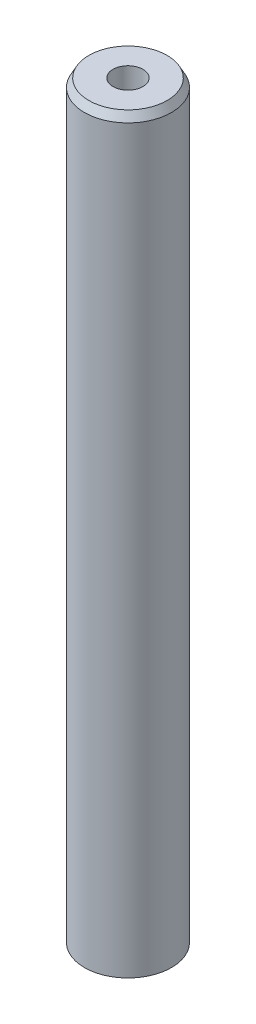
ISO-10303-21;
HEADER;
FILE_DESCRIPTION(('STEP AP214'),'2;1');
FILE_NAME('part.step','',(''),(''),'','','');
FILE_SCHEMA(('AUTOMOTIVE_DESIGN { 1 0 10303 214 1 1 1 1 }'));
ENDSEC;
DATA;
#1=APPLICATION_CONTEXT('core data for automotive mechanical design processes');
#2=APPLICATION_PROTOCOL_DEFINITION('international standard','automotive_design',2000,#1);
#3=PRODUCT_CONTEXT('',#1,'mechanical');
#4=PRODUCT('Part','Part','',(#3));
#5=PRODUCT_RELATED_PRODUCT_CATEGORY('part','',(#4));
#6=PRODUCT_DEFINITION_FORMATION('','',#4);
#7=PRODUCT_DEFINITION_CONTEXT('part definition',#1,'design');
#8=PRODUCT_DEFINITION('design','',#6,#7);
#9=PRODUCT_DEFINITION_SHAPE('','',#8);
#10=(LENGTH_UNIT() NAMED_UNIT(*) SI_UNIT(.MILLI.,.METRE.));
#11=(NAMED_UNIT(*) PLANE_ANGLE_UNIT() SI_UNIT($,.RADIAN.));
#12=(NAMED_UNIT(*) SI_UNIT($,.STERADIAN.) SOLID_ANGLE_UNIT());
#13=UNCERTAINTY_MEASURE_WITH_UNIT(LENGTH_MEASURE(1.E-05),#10,'distance_accuracy_value','');
#14=(GEOMETRIC_REPRESENTATION_CONTEXT(3) GLOBAL_UNCERTAINTY_ASSIGNED_CONTEXT((#13)) GLOBAL_UNIT_ASSIGNED_CONTEXT((#10,
#11,#12)) REPRESENTATION_CONTEXT('',''));
#15=CARTESIAN_POINT('',(0.,0.,0.));
#16=DIRECTION('',(0.,0.,1.));
#17=DIRECTION('',(1.,0.,0.));
#18=AXIS2_PLACEMENT_3D('',#15,#16,#17);
#19=CARTESIAN_POINT('',(0.,259.52281360539,0.));
#20=DIRECTION('',(0.,-1.,0.));
#21=DIRECTION('',(0.,0.,-1.));
#22=AXIS2_PLACEMENT_3D('',#19,#20,#21);
#23=CYLINDRICAL_SURFACE('',#22,15.);
#24=CARTESIAN_POINT('',(0.,256.701081038705,0.));
#25=DIRECTION('',(0.,1.,0.));
#26=DIRECTION('',(0.,0.,1.));
#27=AXIS2_PLACEMENT_3D('',#24,#25,#26);
#28=CIRCLE('',#27,15.);
#29=CARTESIAN_POINT('',(0.,256.701081038705,15.));
#30=VERTEX_POINT('',#29);
#31=EDGE_CURVE('E50',#30,#30,#28,.F.);
#32=ORIENTED_EDGE('',*,*,#31,.T.);
#33=EDGE_LOOP('',(#32));
#34=FACE_BOUND('',#33,.T.);
#35=CARTESIAN_POINT('',(0.,1.5178829982721,0.));
#36=DIRECTION('',(0.,1.,0.));
#37=DIRECTION('',(0.,0.,1.));
#38=AXIS2_PLACEMENT_3D('',#35,#36,#37);
#39=CIRCLE('',#38,15.);
#40=CARTESIAN_POINT('',(0.,1.5178829982721,15.));
#41=VERTEX_POINT('',#40);
#42=EDGE_CURVE('E51',#41,#41,#39,.T.);
#43=ORIENTED_EDGE('',*,*,#42,.T.);
#44=EDGE_LOOP('',(#43));
#45=FACE_BOUND('',#44,.T.);
#46=ADVANCED_FACE('F39',(#34,#45),#23,.T.);
#47=CARTESIAN_POINT('',(0.,259.52281360539,0.));
#48=DIRECTION('',(0.,1.,0.));
#49=DIRECTION('',(0.,0.,1.));
#50=AXIS2_PLACEMENT_3D('',#47,#48,#49);
#51=PLANE('',#50);
#52=CARTESIAN_POINT('',(0.,259.52281360539,0.));
#53=DIRECTION('',(0.,1.,0.));
#54=DIRECTION('',(0.,0.,1.));
#55=AXIS2_PLACEMENT_3D('',#52,#53,#54);
#56=CIRCLE('',#55,13.482117001728);
#57=CARTESIAN_POINT('',(0.,259.52281360539,13.482117001728));
#58=VERTEX_POINT('',#57);
#59=EDGE_CURVE('E54',#58,#58,#56,.T.);
#60=ORIENTED_EDGE('',*,*,#59,.T.);
#61=EDGE_LOOP('',(#60));
#62=FACE_BOUND('',#61,.T.);
#63=CARTESIAN_POINT('',(0.,259.52281360539,0.));
#64=DIRECTION('',(0.,1.,0.));
#65=DIRECTION('',(0.,0.,1.));
#66=AXIS2_PLACEMENT_3D('',#63,#64,#65);
#67=CIRCLE('',#66,5.16552825428991);
#68=CARTESIAN_POINT('',(0.,259.52281360539,5.16552825428991));
#69=VERTEX_POINT('',#68);
#70=EDGE_CURVE('E58',#69,#69,#67,.T.);
#71=ORIENTED_EDGE('',*,*,#70,.F.);
#72=EDGE_LOOP('',(#71));
#73=FACE_BOUND('',#72,.T.);
#74=ADVANCED_FACE('F69',(#62,#73),#51,.T.);
#75=CARTESIAN_POINT('',(0.,0.,0.));
#76=DIRECTION('',(0.,1.,0.));
#77=DIRECTION('',(0.,0.,1.));
#78=AXIS2_PLACEMENT_3D('',#75,#76,#77);
#79=PLANE('',#78);
#80=CARTESIAN_POINT('',(0.,0.,0.));
#81=DIRECTION('',(0.,1.,0.));
#82=DIRECTION('',(0.,0.,1.));
#83=AXIS2_PLACEMENT_3D('',#80,#81,#82);
#84=CIRCLE('',#83,12.1782674333145);
#85=CARTESIAN_POINT('',(0.,0.,12.1782674333145));
#86=VERTEX_POINT('',#85);
#87=EDGE_CURVE('E10',#86,#86,#84,.F.);
#88=ORIENTED_EDGE('',*,*,#87,.T.);
#89=EDGE_LOOP('',(#88));
#90=FACE_BOUND('',#89,.T.);
#91=CARTESIAN_POINT('',(0.,0.,0.));
#92=DIRECTION('',(0.,1.,0.));
#93=DIRECTION('',(0.,0.,1.));
#94=AXIS2_PLACEMENT_3D('',#91,#92,#93);
#95=CIRCLE('',#94,5.16552825428991);
#96=CARTESIAN_POINT('',(0.,0.,5.16552825428991));
#97=VERTEX_POINT('',#96);
#98=EDGE_CURVE('E63',#97,#97,#95,.T.);
#99=ORIENTED_EDGE('',*,*,#98,.T.);
#100=EDGE_LOOP('',(#99));
#101=FACE_BOUND('',#100,.T.);
#102=ADVANCED_FACE('F75',(#90,#101),#79,.F.);
#103=CARTESIAN_POINT('',(0.,259.52281360539,0.));
#104=DIRECTION('',(0.,-1.,0.));
#105=DIRECTION('',(0.,0.,-1.));
#106=AXIS2_PLACEMENT_3D('',#103,#104,#105);
#107=CYLINDRICAL_SURFACE('',#106,5.16552825428991);
#108=ORIENTED_EDGE('',*,*,#70,.T.);
#109=EDGE_LOOP('',(#108));
#110=FACE_BOUND('',#109,.T.);
#111=ORIENTED_EDGE('',*,*,#98,.F.);
#112=EDGE_LOOP('',(#111));
#113=FACE_BOUND('',#112,.T.);
#114=ADVANCED_FACE('F70',(#110,#113),#107,.F.);
#115=CARTESIAN_POINT('',(0.,259.52281360539,0.));
#116=DIRECTION('',(0.,-1.,0.));
#117=DIRECTION('',(0.,0.,-1.));
#118=AXIS2_PLACEMENT_3D('',#115,#116,#117);
#119=CONICAL_SURFACE('',#118,13.482117001728,0.493526024560794);
#120=ORIENTED_EDGE('',*,*,#31,.F.);
#121=EDGE_LOOP('',(#120));
#122=FACE_BOUND('',#121,.T.);
#123=ORIENTED_EDGE('',*,*,#59,.F.);
#124=EDGE_LOOP('',(#123));
#125=FACE_BOUND('',#124,.T.);
#126=ADVANCED_FACE('F81',(#122,#125),#119,.T.);
#127=CARTESIAN_POINT('',(0.,1.5178829982721,0.));
#128=DIRECTION('',(0.,1.,0.));
#129=DIRECTION('',(0.,0.,1.));
#130=AXIS2_PLACEMENT_3D('',#127,#128,#129);
#131=CONICAL_SURFACE('',#130,15.,1.07727030223411);
#132=ORIENTED_EDGE('',*,*,#87,.F.);
#133=EDGE_LOOP('',(#132));
#134=FACE_BOUND('',#133,.T.);
#135=ORIENTED_EDGE('',*,*,#42,.F.);
#136=EDGE_LOOP('',(#135));
#137=FACE_BOUND('',#136,.T.);
#138=ADVANCED_FACE('F45',(#134,#137),#131,.T.);
#139=CLOSED_SHELL('',(#46,#74,#102,#114,#126,#138));
#140=MANIFOLD_SOLID_BREP('B2',#139);
#141=ADVANCED_BREP_SHAPE_REPRESENTATION('',(#18,#140),#14);
#142=SHAPE_DEFINITION_REPRESENTATION(#9,#141);
ENDSEC;
END-ISO-10303-21;
